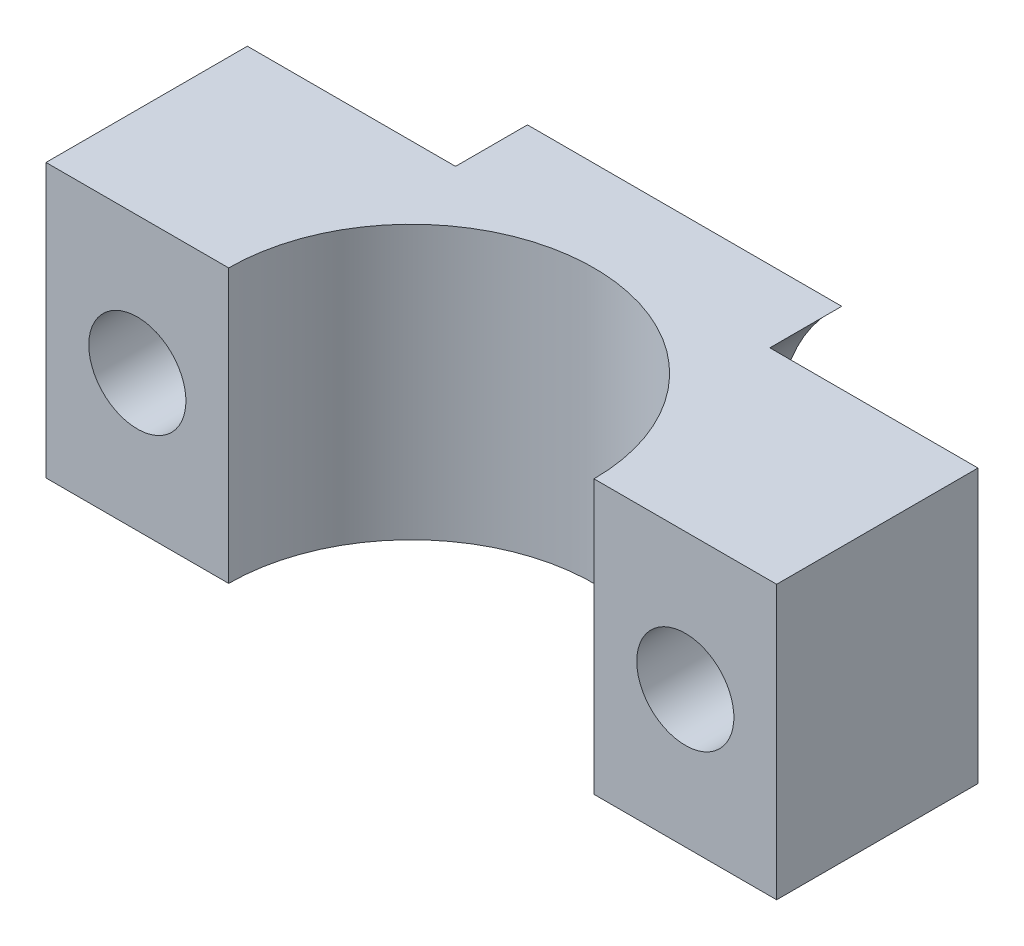
ISO-10303-21;
HEADER;
FILE_DESCRIPTION(('STEP AP214'),'2;1');
FILE_NAME('part.step','',(''),(''),'','','');
FILE_SCHEMA(('AUTOMOTIVE_DESIGN { 1 0 10303 214 1 1 1 1 }'));
ENDSEC;
DATA;
#1=APPLICATION_CONTEXT('core data for automotive mechanical design processes');
#2=APPLICATION_PROTOCOL_DEFINITION('international standard','automotive_design',2000,#1);
#3=PRODUCT_CONTEXT('',#1,'mechanical');
#4=PRODUCT('Part','Part','',(#3));
#5=PRODUCT_RELATED_PRODUCT_CATEGORY('part','',(#4));
#6=PRODUCT_DEFINITION_FORMATION('','',#4);
#7=PRODUCT_DEFINITION_CONTEXT('part definition',#1,'design');
#8=PRODUCT_DEFINITION('design','',#6,#7);
#9=PRODUCT_DEFINITION_SHAPE('','',#8);
#10=(LENGTH_UNIT() NAMED_UNIT(*) SI_UNIT(.MILLI.,.METRE.));
#11=(NAMED_UNIT(*) PLANE_ANGLE_UNIT() SI_UNIT($,.RADIAN.));
#12=(NAMED_UNIT(*) SI_UNIT($,.STERADIAN.) SOLID_ANGLE_UNIT());
#13=UNCERTAINTY_MEASURE_WITH_UNIT(LENGTH_MEASURE(1.E-05),#10,'distance_accuracy_value','');
#14=(GEOMETRIC_REPRESENTATION_CONTEXT(3) GLOBAL_UNCERTAINTY_ASSIGNED_CONTEXT((#13)) GLOBAL_UNIT_ASSIGNED_CONTEXT((#10,
#11,#12)) REPRESENTATION_CONTEXT('',''));
#15=CARTESIAN_POINT('',(0.,0.,0.));
#16=DIRECTION('',(0.,0.,1.));
#17=DIRECTION('',(1.,0.,0.));
#18=AXIS2_PLACEMENT_3D('',#15,#16,#17);
#19=CARTESIAN_POINT('',(0.,19.,0.));
#20=DIRECTION('',(0.,-1.,0.));
#21=DIRECTION('',(0.,0.,-1.));
#22=AXIS2_PLACEMENT_3D('',#19,#20,#21);
#23=CYLINDRICAL_SURFACE('',#22,12.7);
#24=CARTESIAN_POINT('',(0.,0.,0.));
#25=DIRECTION('',(0.,1.,0.));
#26=DIRECTION('',(0.,0.,1.));
#27=AXIS2_PLACEMENT_3D('',#24,#25,#26);
#28=CIRCLE('',#27,12.7);
#29=CARTESIAN_POINT('',(12.7,0.,0.));
#30=VERTEX_POINT('',#29);
#31=CARTESIAN_POINT('',(-12.7,0.,0.));
#32=VERTEX_POINT('',#31);
#33=EDGE_CURVE('E143',#30,#32,#28,.T.);
#34=ORIENTED_EDGE('',*,*,#33,.F.);
#35=DIRECTION('',(0.,-1.,0.));
#36=VECTOR('',#35,1.);
#37=CARTESIAN_POINT('',(12.7,19.,0.));
#38=LINE('',#37,#36);
#39=CARTESIAN_POINT('',(12.7,19.,0.));
#40=VERTEX_POINT('',#39);
#41=EDGE_CURVE('E165',#40,#30,#38,.T.);
#42=ORIENTED_EDGE('',*,*,#41,.F.);
#43=CARTESIAN_POINT('',(0.,19.,0.));
#44=DIRECTION('',(0.,1.,0.));
#45=DIRECTION('',(0.,0.,1.));
#46=AXIS2_PLACEMENT_3D('',#43,#44,#45);
#47=CIRCLE('',#46,12.7);
#48=CARTESIAN_POINT('',(-12.7,19.,0.));
#49=VERTEX_POINT('',#48);
#50=EDGE_CURVE('E136',#40,#49,#47,.T.);
#51=ORIENTED_EDGE('',*,*,#50,.T.);
#52=DIRECTION('',(0.,-1.,0.));
#53=VECTOR('',#52,1.);
#54=CARTESIAN_POINT('',(-12.7,19.,0.));
#55=LINE('',#54,#53);
#56=EDGE_CURVE('E159',#49,#32,#55,.T.);
#57=ORIENTED_EDGE('',*,*,#56,.T.);
#58=EDGE_LOOP('',(#34,#42,#51,#57));
#59=FACE_BOUND('',#58,.T.);
#60=ADVANCED_FACE('F34',(#59),#23,.F.);
#61=CARTESIAN_POINT('',(0.,19.,0.));
#62=DIRECTION('',(0.,0.,1.));
#63=DIRECTION('',(1.,0.,0.));
#64=AXIS2_PLACEMENT_3D('',#61,#62,#63);
#65=PLANE('',#64);
#66=CARTESIAN_POINT('',(19.05,9.5,0.));
#67=DIRECTION('',(0.,0.,-1.));
#68=DIRECTION('',(-1.,0.,0.));
#69=AXIS2_PLACEMENT_3D('',#66,#67,#68);
#70=CIRCLE('',#69,3.375);
#71=CARTESIAN_POINT('',(15.675,9.5,0.));
#72=VERTEX_POINT('',#71);
#73=EDGE_CURVE('E220',#72,#72,#70,.T.);
#74=ORIENTED_EDGE('',*,*,#73,.T.);
#75=EDGE_LOOP('',(#74));
#76=FACE_BOUND('',#75,.T.);
#77=DIRECTION('',(-1.,0.,0.));
#78=VECTOR('',#77,1.);
#79=CARTESIAN_POINT('',(0.,0.,0.));
#80=LINE('',#79,#78);
#81=CARTESIAN_POINT('',(25.4,0.,0.));
#82=VERTEX_POINT('',#81);
#83=EDGE_CURVE('E146',#82,#30,#80,.T.);
#84=ORIENTED_EDGE('',*,*,#83,.F.);
#85=DIRECTION('',(0.,-1.,0.));
#86=VECTOR('',#85,1.);
#87=CARTESIAN_POINT('',(25.4,19.,0.));
#88=LINE('',#87,#86);
#89=CARTESIAN_POINT('',(25.4,19.,0.));
#90=VERTEX_POINT('',#89);
#91=EDGE_CURVE('E163',#90,#82,#88,.T.);
#92=ORIENTED_EDGE('',*,*,#91,.F.);
#93=DIRECTION('',(-1.,0.,0.));
#94=VECTOR('',#93,1.);
#95=CARTESIAN_POINT('',(0.,19.,0.));
#96=LINE('',#95,#94);
#97=EDGE_CURVE('E130',#90,#40,#96,.T.);
#98=ORIENTED_EDGE('',*,*,#97,.T.);
#99=ORIENTED_EDGE('',*,*,#41,.T.);
#100=EDGE_LOOP('',(#84,#92,#98,#99));
#101=FACE_BOUND('',#100,.T.);
#102=ADVANCED_FACE('F216',(#76,#101),#65,.T.);
#103=CARTESIAN_POINT('',(25.4,19.,0.));
#104=DIRECTION('',(-1.,0.,0.));
#105=DIRECTION('',(0.,0.,1.));
#106=AXIS2_PLACEMENT_3D('',#103,#104,#105);
#107=PLANE('',#106);
#108=DIRECTION('',(0.,0.,-1.));
#109=VECTOR('',#108,1.);
#110=CARTESIAN_POINT('',(25.4,0.,0.));
#111=LINE('',#110,#109);
#112=CARTESIAN_POINT('',(25.4,0.,-14.));
#113=VERTEX_POINT('',#112);
#114=EDGE_CURVE('E150',#82,#113,#111,.T.);
#115=ORIENTED_EDGE('',*,*,#114,.T.);
#116=DIRECTION('',(0.,1.,0.));
#117=VECTOR('',#116,1.);
#118=CARTESIAN_POINT('',(25.4,19.,-14.));
#119=LINE('',#118,#117);
#120=CARTESIAN_POINT('',(25.4,19.,-14.));
#121=VERTEX_POINT('',#120);
#122=EDGE_CURVE('E188',#113,#121,#119,.T.);
#123=ORIENTED_EDGE('',*,*,#122,.T.);
#124=DIRECTION('',(0.,0.,-1.));
#125=VECTOR('',#124,1.);
#126=CARTESIAN_POINT('',(25.4,19.,0.));
#127=LINE('',#126,#125);
#128=EDGE_CURVE('E127',#90,#121,#127,.T.);
#129=ORIENTED_EDGE('',*,*,#128,.F.);
#130=ORIENTED_EDGE('',*,*,#91,.T.);
#131=EDGE_LOOP('',(#115,#123,#129,#130));
#132=FACE_BOUND('',#131,.T.);
#133=ADVANCED_FACE('F218',(#132),#107,.F.);
#134=CARTESIAN_POINT('',(0.,19.,-19.));
#135=DIRECTION('',(0.,0.,1.));
#136=DIRECTION('',(1.,0.,0.));
#137=AXIS2_PLACEMENT_3D('',#134,#135,#136);
#138=PLANE('',#137);
#139=DIRECTION('',(-1.,0.,0.));
#140=VECTOR('',#139,1.);
#141=CARTESIAN_POINT('',(0.,19.,-19.));
#142=LINE('',#141,#140);
#143=CARTESIAN_POINT('',(10.925961595364,19.,-19.));
#144=VERTEX_POINT('',#143);
#145=CARTESIAN_POINT('',(-10.925961595364,19.,-19.));
#146=VERTEX_POINT('',#145);
#147=EDGE_CURVE('E132',#144,#146,#142,.T.);
#148=ORIENTED_EDGE('',*,*,#147,.F.);
#149=CARTESIAN_POINT('',(19.05,9.5,-19.));
#150=DIRECTION('',(0.,0.,-1.));
#151=DIRECTION('',(-1.,0.,0.));
#152=AXIS2_PLACEMENT_3D('',#149,#150,#151);
#153=CIRCLE('',#152,12.5);
#154=CARTESIAN_POINT('',(10.925961595364,0.,-19.));
#155=VERTEX_POINT('',#154);
#156=EDGE_CURVE('E48',#155,#144,#153,.T.);
#157=ORIENTED_EDGE('',*,*,#156,.F.);
#158=DIRECTION('',(-1.,0.,0.));
#159=VECTOR('',#158,1.);
#160=CARTESIAN_POINT('',(0.,0.,-19.));
#161=LINE('',#160,#159);
#162=CARTESIAN_POINT('',(-10.925961595364,0.,-19.));
#163=VERTEX_POINT('',#162);
#164=EDGE_CURVE('E154',#155,#163,#161,.T.);
#165=ORIENTED_EDGE('',*,*,#164,.T.);
#166=CARTESIAN_POINT('',(-19.05,9.5,-19.));
#167=DIRECTION('',(0.,0.,-1.));
#168=DIRECTION('',(-1.,0.,0.));
#169=AXIS2_PLACEMENT_3D('',#166,#167,#168);
#170=CIRCLE('',#169,12.5);
#171=EDGE_CURVE('E180',#146,#163,#170,.T.);
#172=ORIENTED_EDGE('',*,*,#171,.F.);
#173=EDGE_LOOP('',(#148,#157,#165,#172));
#174=FACE_BOUND('',#173,.T.);
#175=ADVANCED_FACE('F183',(#174),#138,.F.);
#176=CARTESIAN_POINT('',(-25.4,19.,0.));
#177=DIRECTION('',(-1.,0.,0.));
#178=DIRECTION('',(0.,0.,1.));
#179=AXIS2_PLACEMENT_3D('',#176,#177,#178);
#180=PLANE('',#179);
#181=DIRECTION('',(0.,1.,0.));
#182=VECTOR('',#181,1.);
#183=CARTESIAN_POINT('',(-25.4,19.,-14.));
#184=LINE('',#183,#182);
#185=CARTESIAN_POINT('',(-25.4,0.,-14.));
#186=VERTEX_POINT('',#185);
#187=CARTESIAN_POINT('',(-25.4,19.,-14.));
#188=VERTEX_POINT('',#187);
#189=EDGE_CURVE('E175',#186,#188,#184,.T.);
#190=ORIENTED_EDGE('',*,*,#189,.F.);
#191=DIRECTION('',(0.,0.,-1.));
#192=VECTOR('',#191,1.);
#193=CARTESIAN_POINT('',(-25.4,0.,0.));
#194=LINE('',#193,#192);
#195=CARTESIAN_POINT('',(-25.4,0.,0.));
#196=VERTEX_POINT('',#195);
#197=EDGE_CURVE('E156',#196,#186,#194,.T.);
#198=ORIENTED_EDGE('',*,*,#197,.F.);
#199=DIRECTION('',(0.,-1.,0.));
#200=VECTOR('',#199,1.);
#201=CARTESIAN_POINT('',(-25.4,19.,0.));
#202=LINE('',#201,#200);
#203=CARTESIAN_POINT('',(-25.4,19.,0.));
#204=VERTEX_POINT('',#203);
#205=EDGE_CURVE('E161',#204,#196,#202,.T.);
#206=ORIENTED_EDGE('',*,*,#205,.F.);
#207=DIRECTION('',(0.,0.,-1.));
#208=VECTOR('',#207,1.);
#209=CARTESIAN_POINT('',(-25.4,19.,0.));
#210=LINE('',#209,#208);
#211=EDGE_CURVE('E134',#204,#188,#210,.T.);
#212=ORIENTED_EDGE('',*,*,#211,.T.);
#213=EDGE_LOOP('',(#190,#198,#206,#212));
#214=FACE_BOUND('',#213,.T.);
#215=ADVANCED_FACE('F213',(#214),#180,.T.);
#216=CARTESIAN_POINT('',(-19.05,9.5,0.));
#217=DIRECTION('',(0.,0.,-1.));
#218=DIRECTION('',(-1.,0.,0.));
#219=AXIS2_PLACEMENT_3D('',#216,#217,#218);
#220=CIRCLE('',#219,3.375);
#221=CARTESIAN_POINT('',(-22.425,9.5,0.));
#222=VERTEX_POINT('',#221);
#223=EDGE_CURVE('E194',#222,#222,#220,.T.);
#224=ORIENTED_EDGE('',*,*,#223,.T.);
#225=EDGE_LOOP('',(#224));
#226=FACE_BOUND('',#225,.T.);
#227=EDGE_CURVE('E151',#32,#196,#80,.T.);
#228=ORIENTED_EDGE('',*,*,#227,.F.);
#229=ORIENTED_EDGE('',*,*,#56,.F.);
#230=EDGE_CURVE('E138',#49,#204,#96,.T.);
#231=ORIENTED_EDGE('',*,*,#230,.T.);
#232=ORIENTED_EDGE('',*,*,#205,.T.);
#233=EDGE_LOOP('',(#228,#229,#231,#232));
#234=FACE_BOUND('',#233,.T.);
#235=ADVANCED_FACE('F210',(#226,#234),#65,.T.);
#236=CARTESIAN_POINT('',(0.,19.,0.));
#237=DIRECTION('',(0.,1.,0.));
#238=DIRECTION('',(0.,0.,1.));
#239=AXIS2_PLACEMENT_3D('',#236,#237,#238);
#240=PLANE('',#239);
#241=DIRECTION('',(1.,0.,0.));
#242=VECTOR('',#241,1.);
#243=CARTESIAN_POINT('',(0.,19.,-14.));
#244=LINE('',#243,#242);
#245=CARTESIAN_POINT('',(10.925961595364,19.,-14.));
#246=VERTEX_POINT('',#245);
#247=EDGE_CURVE('E11',#246,#121,#244,.T.);
#248=ORIENTED_EDGE('',*,*,#247,.F.);
#249=DIRECTION('',(0.,0.,-1.));
#250=VECTOR('',#249,1.);
#251=CARTESIAN_POINT('',(10.925961595364,19.,-19.));
#252=LINE('',#251,#250);
#253=EDGE_CURVE('E41',#144,#246,#252,.F.);
#254=ORIENTED_EDGE('',*,*,#253,.F.);
#255=ORIENTED_EDGE('',*,*,#147,.T.);
#256=DIRECTION('',(0.,0.,-1.));
#257=VECTOR('',#256,1.);
#258=CARTESIAN_POINT('',(-10.925961595364,19.,-19.));
#259=LINE('',#258,#257);
#260=CARTESIAN_POINT('',(-10.925961595364,19.,-14.));
#261=VERTEX_POINT('',#260);
#262=EDGE_CURVE('E167',#261,#146,#259,.T.);
#263=ORIENTED_EDGE('',*,*,#262,.F.);
#264=DIRECTION('',(1.,0.,0.));
#265=VECTOR('',#264,1.);
#266=CARTESIAN_POINT('',(0.,19.,-14.));
#267=LINE('',#266,#265);
#268=EDGE_CURVE('E115',#188,#261,#267,.T.);
#269=ORIENTED_EDGE('',*,*,#268,.F.);
#270=ORIENTED_EDGE('',*,*,#211,.F.);
#271=ORIENTED_EDGE('',*,*,#230,.F.);
#272=ORIENTED_EDGE('',*,*,#50,.F.);
#273=ORIENTED_EDGE('',*,*,#97,.F.);
#274=ORIENTED_EDGE('',*,*,#128,.T.);
#275=EDGE_LOOP('',(#248,#254,#255,#263,#269,#270,#271,#272,#273,#274));
#276=FACE_BOUND('',#275,.T.);
#277=ADVANCED_FACE('F124',(#276),#240,.T.);
#278=CARTESIAN_POINT('',(0.,0.,0.));
#279=DIRECTION('',(0.,1.,0.));
#280=DIRECTION('',(0.,0.,1.));
#281=AXIS2_PLACEMENT_3D('',#278,#279,#280);
#282=PLANE('',#281);
#283=DIRECTION('',(0.,0.,-1.));
#284=VECTOR('',#283,1.);
#285=CARTESIAN_POINT('',(10.925961595364,0.,-19.));
#286=LINE('',#285,#284);
#287=CARTESIAN_POINT('',(10.925961595364,0.,-14.));
#288=VERTEX_POINT('',#287);
#289=EDGE_CURVE('E219',#155,#288,#286,.F.);
#290=ORIENTED_EDGE('',*,*,#289,.T.);
#291=DIRECTION('',(1.,0.,0.));
#292=VECTOR('',#291,1.);
#293=CARTESIAN_POINT('',(0.,0.,-14.));
#294=LINE('',#293,#292);
#295=EDGE_CURVE('E120',#288,#113,#294,.T.);
#296=ORIENTED_EDGE('',*,*,#295,.T.);
#297=ORIENTED_EDGE('',*,*,#114,.F.);
#298=ORIENTED_EDGE('',*,*,#83,.T.);
#299=ORIENTED_EDGE('',*,*,#33,.T.);
#300=ORIENTED_EDGE('',*,*,#227,.T.);
#301=ORIENTED_EDGE('',*,*,#197,.T.);
#302=DIRECTION('',(1.,0.,0.));
#303=VECTOR('',#302,1.);
#304=CARTESIAN_POINT('',(0.,0.,-14.));
#305=LINE('',#304,#303);
#306=CARTESIAN_POINT('',(-10.925961595364,0.,-14.));
#307=VERTEX_POINT('',#306);
#308=EDGE_CURVE('E147',#186,#307,#305,.T.);
#309=ORIENTED_EDGE('',*,*,#308,.T.);
#310=DIRECTION('',(0.,0.,-1.));
#311=VECTOR('',#310,1.);
#312=CARTESIAN_POINT('',(-10.925961595364,0.,-19.));
#313=LINE('',#312,#311);
#314=EDGE_CURVE('E197',#307,#163,#313,.T.);
#315=ORIENTED_EDGE('',*,*,#314,.T.);
#316=ORIENTED_EDGE('',*,*,#164,.F.);
#317=EDGE_LOOP('',(#290,#296,#297,#298,#299,#300,#301,#309,#315,#316));
#318=FACE_BOUND('',#317,.T.);
#319=ADVANCED_FACE('F206',(#318),#282,.F.);
#320=CARTESIAN_POINT('',(-15.675,9.5,-14.));
#321=DIRECTION('',(0.,0.,1.));
#322=DIRECTION('',(1.,0.,0.));
#323=AXIS2_PLACEMENT_3D('',#320,#321,#322);
#324=PLANE('',#323);
#325=CARTESIAN_POINT('',(-19.05,9.5,-14.));
#326=DIRECTION('',(0.,0.,-1.));
#327=DIRECTION('',(-1.,0.,0.));
#328=AXIS2_PLACEMENT_3D('',#325,#326,#327);
#329=CIRCLE('',#328,3.37500000000001);
#330=CARTESIAN_POINT('',(-22.425,9.5,-14.));
#331=VERTEX_POINT('',#330);
#332=EDGE_CURVE('E186',#331,#331,#329,.T.);
#333=ORIENTED_EDGE('',*,*,#332,.F.);
#334=EDGE_LOOP('',(#333));
#335=FACE_BOUND('',#334,.T.);
#336=ORIENTED_EDGE('',*,*,#189,.T.);
#337=ORIENTED_EDGE('',*,*,#268,.T.);
#338=CARTESIAN_POINT('',(-19.05,9.5,-14.));
#339=DIRECTION('',(0.,0.,-1.));
#340=DIRECTION('',(-1.,0.,0.));
#341=AXIS2_PLACEMENT_3D('',#338,#339,#340);
#342=CIRCLE('',#341,12.5);
#343=EDGE_CURVE('E56',#261,#307,#342,.T.);
#344=ORIENTED_EDGE('',*,*,#343,.T.);
#345=ORIENTED_EDGE('',*,*,#308,.F.);
#346=EDGE_LOOP('',(#336,#337,#344,#345));
#347=FACE_BOUND('',#346,.T.);
#348=ADVANCED_FACE('F172',(#335,#347),#324,.F.);
#349=CARTESIAN_POINT('',(-19.05,9.5,-19.));
#350=DIRECTION('',(0.,0.,-1.));
#351=DIRECTION('',(-1.,0.,0.));
#352=AXIS2_PLACEMENT_3D('',#349,#350,#351);
#353=CYLINDRICAL_SURFACE('',#352,12.5);
#354=ORIENTED_EDGE('',*,*,#343,.F.);
#355=ORIENTED_EDGE('',*,*,#262,.T.);
#356=ORIENTED_EDGE('',*,*,#171,.T.);
#357=ORIENTED_EDGE('',*,*,#314,.F.);
#358=EDGE_LOOP('',(#354,#355,#356,#357));
#359=FACE_BOUND('',#358,.T.);
#360=ADVANCED_FACE('F179',(#359),#353,.F.);
#361=CARTESIAN_POINT('',(-19.05,9.5,-19.));
#362=DIRECTION('',(0.,0.,-1.));
#363=DIRECTION('',(-1.,0.,0.));
#364=AXIS2_PLACEMENT_3D('',#361,#362,#363);
#365=CYLINDRICAL_SURFACE('',#364,3.375);
#366=ORIENTED_EDGE('',*,*,#223,.F.);
#367=EDGE_LOOP('',(#366));
#368=FACE_BOUND('',#367,.T.);
#369=ORIENTED_EDGE('',*,*,#332,.T.);
#370=EDGE_LOOP('',(#369));
#371=FACE_BOUND('',#370,.T.);
#372=ADVANCED_FACE('F232',(#368,#371),#365,.F.);
#373=CARTESIAN_POINT('',(22.425,9.5,-14.));
#374=DIRECTION('',(0.,0.,1.));
#375=DIRECTION('',(1.,0.,0.));
#376=AXIS2_PLACEMENT_3D('',#373,#374,#375);
#377=PLANE('',#376);
#378=CARTESIAN_POINT('',(19.05,9.5,-14.));
#379=DIRECTION('',(0.,0.,-1.));
#380=DIRECTION('',(-1.,0.,0.));
#381=AXIS2_PLACEMENT_3D('',#378,#379,#380);
#382=CIRCLE('',#381,3.37500000000001);
#383=CARTESIAN_POINT('',(15.675,9.5,-14.));
#384=VERTEX_POINT('',#383);
#385=EDGE_CURVE('E121',#384,#384,#382,.T.);
#386=ORIENTED_EDGE('',*,*,#385,.F.);
#387=EDGE_LOOP('',(#386));
#388=FACE_BOUND('',#387,.T.);
#389=CARTESIAN_POINT('',(19.05,9.5,-14.));
#390=DIRECTION('',(0.,0.,-1.));
#391=DIRECTION('',(-1.,0.,0.));
#392=AXIS2_PLACEMENT_3D('',#389,#390,#391);
#393=CIRCLE('',#392,12.5);
#394=EDGE_CURVE('E110',#288,#246,#393,.T.);
#395=ORIENTED_EDGE('',*,*,#394,.T.);
#396=ORIENTED_EDGE('',*,*,#247,.T.);
#397=ORIENTED_EDGE('',*,*,#122,.F.);
#398=ORIENTED_EDGE('',*,*,#295,.F.);
#399=EDGE_LOOP('',(#395,#396,#397,#398));
#400=FACE_BOUND('',#399,.T.);
#401=ADVANCED_FACE('F117',(#388,#400),#377,.F.);
#402=CARTESIAN_POINT('',(19.05,9.5,-19.));
#403=DIRECTION('',(0.,0.,-1.));
#404=DIRECTION('',(-1.,0.,0.));
#405=AXIS2_PLACEMENT_3D('',#402,#403,#404);
#406=CYLINDRICAL_SURFACE('',#405,12.5);
#407=ORIENTED_EDGE('',*,*,#156,.T.);
#408=ORIENTED_EDGE('',*,*,#253,.T.);
#409=ORIENTED_EDGE('',*,*,#394,.F.);
#410=ORIENTED_EDGE('',*,*,#289,.F.);
#411=EDGE_LOOP('',(#407,#408,#409,#410));
#412=FACE_BOUND('',#411,.T.);
#413=ADVANCED_FACE('F109',(#412),#406,.F.);
#414=CARTESIAN_POINT('',(19.05,9.5,-19.));
#415=DIRECTION('',(0.,0.,-1.));
#416=DIRECTION('',(-1.,0.,0.));
#417=AXIS2_PLACEMENT_3D('',#414,#415,#416);
#418=CYLINDRICAL_SURFACE('',#417,3.375);
#419=ORIENTED_EDGE('',*,*,#73,.F.);
#420=EDGE_LOOP('',(#419));
#421=FACE_BOUND('',#420,.T.);
#422=ORIENTED_EDGE('',*,*,#385,.T.);
#423=EDGE_LOOP('',(#422));
#424=FACE_BOUND('',#423,.T.);
#425=ADVANCED_FACE('F229',(#421,#424),#418,.F.);
#426=CLOSED_SHELL('',(#60,#102,#133,#175,#215,#235,#277,#319,#348,#360,#372,#401,#413,#425));
#427=MANIFOLD_SOLID_BREP('B2',#426);
#428=ADVANCED_BREP_SHAPE_REPRESENTATION('',(#18,#427),#14);
#429=SHAPE_DEFINITION_REPRESENTATION(#9,#428);
ENDSEC;
END-ISO-10303-21;
